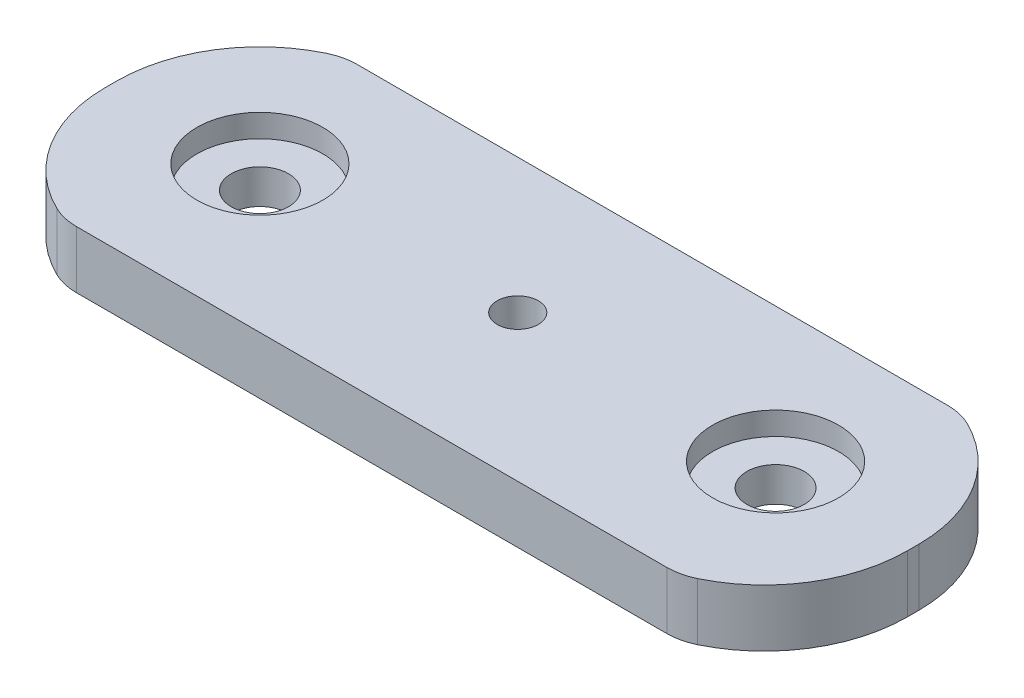
ISO-10303-21;
HEADER;
FILE_DESCRIPTION(('STEP AP214'),'2;1');
FILE_NAME('part.step','',(''),(''),'','','');
FILE_SCHEMA(('AUTOMOTIVE_DESIGN { 1 0 10303 214 1 1 1 1 }'));
ENDSEC;
DATA;
#1=APPLICATION_CONTEXT('core data for automotive mechanical design processes');
#2=APPLICATION_PROTOCOL_DEFINITION('international standard','automotive_design',2000,#1);
#3=PRODUCT_CONTEXT('',#1,'mechanical');
#4=PRODUCT('Part','Part','',(#3));
#5=PRODUCT_RELATED_PRODUCT_CATEGORY('part','',(#4));
#6=PRODUCT_DEFINITION_FORMATION('','',#4);
#7=PRODUCT_DEFINITION_CONTEXT('part definition',#1,'design');
#8=PRODUCT_DEFINITION('design','',#6,#7);
#9=PRODUCT_DEFINITION_SHAPE('','',#8);
#10=(LENGTH_UNIT() NAMED_UNIT(*) SI_UNIT(.MILLI.,.METRE.));
#11=(NAMED_UNIT(*) PLANE_ANGLE_UNIT() SI_UNIT($,.RADIAN.));
#12=(NAMED_UNIT(*) SI_UNIT($,.STERADIAN.) SOLID_ANGLE_UNIT());
#13=UNCERTAINTY_MEASURE_WITH_UNIT(LENGTH_MEASURE(1.E-05),#10,'distance_accuracy_value','');
#14=(GEOMETRIC_REPRESENTATION_CONTEXT(3) GLOBAL_UNCERTAINTY_ASSIGNED_CONTEXT((#13)) GLOBAL_UNIT_ASSIGNED_CONTEXT((#10,
#11,#12)) REPRESENTATION_CONTEXT('',''));
#15=CARTESIAN_POINT('',(0.,0.,0.));
#16=DIRECTION('',(0.,0.,1.));
#17=DIRECTION('',(1.,0.,0.));
#18=AXIS2_PLACEMENT_3D('',#15,#16,#17);
#19=CARTESIAN_POINT('',(-45.,10.,0.));
#20=DIRECTION('',(0.,1.,0.));
#21=DIRECTION('',(0.,0.,1.));
#22=AXIS2_PLACEMENT_3D('',#19,#20,#21);
#23=PLANE('',#22);
#24=CARTESIAN_POINT('',(45.,10.,0.));
#25=DIRECTION('',(0.,1.,0.));
#26=DIRECTION('',(0.,0.,1.));
#27=AXIS2_PLACEMENT_3D('',#24,#25,#26);
#28=CIRCLE('',#27,11.);
#29=CARTESIAN_POINT('',(45.,10.,11.));
#30=VERTEX_POINT('',#29);
#31=EDGE_CURVE('E186',#30,#30,#28,.T.);
#32=ORIENTED_EDGE('',*,*,#31,.F.);
#33=EDGE_LOOP('',(#32));
#34=FACE_BOUND('',#33,.T.);
#35=CARTESIAN_POINT('',(-45.,10.,0.));
#36=DIRECTION('',(0.,1.,0.));
#37=DIRECTION('',(0.,0.,1.));
#38=AXIS2_PLACEMENT_3D('',#35,#36,#37);
#39=CIRCLE('',#38,11.);
#40=CARTESIAN_POINT('',(-45.,10.,11.));
#41=VERTEX_POINT('',#40);
#42=EDGE_CURVE('E203',#41,#41,#39,.T.);
#43=ORIENTED_EDGE('',*,*,#42,.F.);
#44=EDGE_LOOP('',(#43));
#45=FACE_BOUND('',#44,.T.);
#46=DIRECTION('',(1.,0.,0.));
#47=VECTOR('',#46,1.);
#48=CARTESIAN_POINT('',(-61.82898260829,10.,-23.5));
#49=LINE('',#48,#47);
#50=CARTESIAN_POINT('',(-51.538348415311,10.,-23.5));
#51=VERTEX_POINT('',#50);
#52=CARTESIAN_POINT('',(51.538348415311,10.,-23.5));
#53=VERTEX_POINT('',#52);
#54=EDGE_CURVE('E214',#51,#53,#49,.T.);
#55=ORIENTED_EDGE('',*,*,#54,.F.);
#56=CARTESIAN_POINT('',(-51.538348415311,10.,-13.5));
#57=DIRECTION('',(0.,1.,0.));
#58=DIRECTION('',(0.,0.,1.));
#59=AXIS2_PLACEMENT_3D('',#56,#57,#58);
#60=CIRCLE('',#59,10.);
#61=CARTESIAN_POINT('',(-55.8972473588517,10.,-22.5));
#62=VERTEX_POINT('',#61);
#63=EDGE_CURVE('E133',#51,#62,#60,.T.);
#64=ORIENTED_EDGE('',*,*,#63,.T.);
#65=CARTESIAN_POINT('',(-45.,10.,0.));
#66=DIRECTION('',(0.,1.,0.));
#67=DIRECTION('',(0.,0.,1.));
#68=AXIS2_PLACEMENT_3D('',#65,#66,#67);
#69=CIRCLE('',#68,25.);
#70=CARTESIAN_POINT('',(-70.,10.,1.59594559789866E-13));
#71=VERTEX_POINT('',#70);
#72=EDGE_CURVE('E125',#62,#71,#69,.T.);
#73=ORIENTED_EDGE('',*,*,#72,.T.);
#74=DIRECTION('',(0.,0.,1.));
#75=VECTOR('',#74,1.);
#76=CARTESIAN_POINT('',(-70.,10.,1.59594559789866E-13));
#77=LINE('',#76,#75);
#78=CARTESIAN_POINT('',(-70.,10.,1.99999999999982));
#79=VERTEX_POINT('',#78);
#80=EDGE_CURVE('E130',#71,#79,#77,.T.);
#81=ORIENTED_EDGE('',*,*,#80,.T.);
#82=CARTESIAN_POINT('',(-45.,10.,1.99999999999999));
#83=DIRECTION('',(0.,1.,0.));
#84=DIRECTION('',(0.,0.,-1.));
#85=AXIS2_PLACEMENT_3D('',#82,#83,#84);
#86=CIRCLE('',#85,25.);
#87=CARTESIAN_POINT('',(-55.8972473588517,10.,24.5));
#88=VERTEX_POINT('',#87);
#89=EDGE_CURVE('E147',#79,#88,#86,.T.);
#90=ORIENTED_EDGE('',*,*,#89,.T.);
#91=CARTESIAN_POINT('',(-51.538348415311,10.,15.5));
#92=DIRECTION('',(0.,1.,0.));
#93=DIRECTION('',(0.,0.,1.));
#94=AXIS2_PLACEMENT_3D('',#91,#92,#93);
#95=CIRCLE('',#94,10.);
#96=CARTESIAN_POINT('',(-51.538348415311,10.,25.5));
#97=VERTEX_POINT('',#96);
#98=EDGE_CURVE('E51',#88,#97,#95,.T.);
#99=ORIENTED_EDGE('',*,*,#98,.T.);
#100=DIRECTION('',(-1.,0.,0.));
#101=VECTOR('',#100,1.);
#102=CARTESIAN_POINT('',(77.1776293447742,10.,25.5));
#103=LINE('',#102,#101);
#104=CARTESIAN_POINT('',(51.538348415311,10.,25.5));
#105=VERTEX_POINT('',#104);
#106=EDGE_CURVE('E208',#105,#97,#103,.T.);
#107=ORIENTED_EDGE('',*,*,#106,.F.);
#108=CARTESIAN_POINT('',(51.538348415311,10.,15.5));
#109=DIRECTION('',(0.,1.,0.));
#110=DIRECTION('',(0.,0.,1.));
#111=AXIS2_PLACEMENT_3D('',#108,#109,#110);
#112=CIRCLE('',#111,10.);
#113=CARTESIAN_POINT('',(55.8972473588517,10.,24.5));
#114=VERTEX_POINT('',#113);
#115=EDGE_CURVE('E173',#105,#114,#112,.T.);
#116=ORIENTED_EDGE('',*,*,#115,.T.);
#117=CARTESIAN_POINT('',(45.,10.,1.99999999999999));
#118=DIRECTION('',(0.,1.,0.));
#119=DIRECTION('',(0.,0.,-1.));
#120=AXIS2_PLACEMENT_3D('',#117,#118,#119);
#121=CIRCLE('',#120,25.);
#122=CARTESIAN_POINT('',(70.,10.,1.99999999999982));
#123=VERTEX_POINT('',#122);
#124=EDGE_CURVE('E223',#114,#123,#121,.T.);
#125=ORIENTED_EDGE('',*,*,#124,.T.);
#126=DIRECTION('',(0.,0.,-1.));
#127=VECTOR('',#126,1.);
#128=CARTESIAN_POINT('',(70.,10.,1.66533453693773E-13));
#129=LINE('',#128,#127);
#130=CARTESIAN_POINT('',(70.,10.,1.66533453693773E-13));
#131=VERTEX_POINT('',#130);
#132=EDGE_CURVE('E225',#123,#131,#129,.T.);
#133=ORIENTED_EDGE('',*,*,#132,.T.);
#134=CARTESIAN_POINT('',(45.,10.,0.));
#135=DIRECTION('',(0.,1.,0.));
#136=DIRECTION('',(0.,0.,-1.));
#137=AXIS2_PLACEMENT_3D('',#134,#135,#136);
#138=CIRCLE('',#137,25.);
#139=CARTESIAN_POINT('',(55.8972473588517,10.,-22.5));
#140=VERTEX_POINT('',#139);
#141=EDGE_CURVE('E227',#131,#140,#138,.T.);
#142=ORIENTED_EDGE('',*,*,#141,.T.);
#143=CARTESIAN_POINT('',(51.538348415311,10.,-13.5));
#144=DIRECTION('',(0.,1.,0.));
#145=DIRECTION('',(0.,0.,1.));
#146=AXIS2_PLACEMENT_3D('',#143,#144,#145);
#147=CIRCLE('',#146,10.);
#148=EDGE_CURVE('E58',#140,#53,#147,.T.);
#149=ORIENTED_EDGE('',*,*,#148,.T.);
#150=EDGE_LOOP('',(#55,#64,#73,#81,#90,#99,#107,#116,#125,#133,#142,#149));
#151=FACE_BOUND('',#150,.T.);
#152=CARTESIAN_POINT('',(0.,10.,0.));
#153=DIRECTION('',(0.,-1.,0.));
#154=DIRECTION('',(0.,0.,-1.));
#155=AXIS2_PLACEMENT_3D('',#152,#153,#154);
#156=CIRCLE('',#155,3.59);
#157=CARTESIAN_POINT('',(0.,10.,-3.59));
#158=VERTEX_POINT('',#157);
#159=EDGE_CURVE('E493',#158,#158,#156,.T.);
#160=ORIENTED_EDGE('',*,*,#159,.T.);
#161=EDGE_LOOP('',(#160));
#162=FACE_BOUND('',#161,.T.);
#163=ADVANCED_FACE('F34',(#34,#45,#151,#162),#23,.T.);
#164=CARTESIAN_POINT('',(-45.,0.,0.));
#165=DIRECTION('',(0.,1.,0.));
#166=DIRECTION('',(0.,0.,1.));
#167=AXIS2_PLACEMENT_3D('',#164,#165,#166);
#168=PLANE('',#167);
#169=CARTESIAN_POINT('',(45.,0.,0.));
#170=DIRECTION('',(0.,-1.,0.));
#171=DIRECTION('',(0.,0.,-1.));
#172=AXIS2_PLACEMENT_3D('',#169,#170,#171);
#173=CIRCLE('',#172,5.);
#174=CARTESIAN_POINT('',(45.,0.,-5.));
#175=VERTEX_POINT('',#174);
#176=EDGE_CURVE('E198',#175,#175,#173,.T.);
#177=ORIENTED_EDGE('',*,*,#176,.F.);
#178=EDGE_LOOP('',(#177));
#179=FACE_BOUND('',#178,.T.);
#180=CARTESIAN_POINT('',(-45.,0.,0.));
#181=DIRECTION('',(0.,-1.,0.));
#182=DIRECTION('',(0.,0.,-1.));
#183=AXIS2_PLACEMENT_3D('',#180,#181,#182);
#184=CIRCLE('',#183,5.);
#185=CARTESIAN_POINT('',(-45.,0.,-5.));
#186=VERTEX_POINT('',#185);
#187=EDGE_CURVE('E187',#186,#186,#184,.T.);
#188=ORIENTED_EDGE('',*,*,#187,.F.);
#189=EDGE_LOOP('',(#188));
#190=FACE_BOUND('',#189,.T.);
#191=CARTESIAN_POINT('',(-45.,0.,0.));
#192=DIRECTION('',(0.,1.,0.));
#193=DIRECTION('',(0.,0.,1.));
#194=AXIS2_PLACEMENT_3D('',#191,#192,#193);
#195=CIRCLE('',#194,25.);
#196=CARTESIAN_POINT('',(-55.8972473588517,0.,-22.5));
#197=VERTEX_POINT('',#196);
#198=CARTESIAN_POINT('',(-70.,0.,1.59594559789866E-13));
#199=VERTEX_POINT('',#198);
#200=EDGE_CURVE('E151',#197,#199,#195,.T.);
#201=ORIENTED_EDGE('',*,*,#200,.F.);
#202=CARTESIAN_POINT('',(-51.538348415311,0.,-13.5));
#203=DIRECTION('',(0.,1.,0.));
#204=DIRECTION('',(0.,0.,1.));
#205=AXIS2_PLACEMENT_3D('',#202,#203,#204);
#206=CIRCLE('',#205,10.);
#207=CARTESIAN_POINT('',(-51.538348415311,0.,-23.5));
#208=VERTEX_POINT('',#207);
#209=EDGE_CURVE('E166',#197,#208,#206,.F.);
#210=ORIENTED_EDGE('',*,*,#209,.T.);
#211=DIRECTION('',(1.,0.,0.));
#212=VECTOR('',#211,1.);
#213=CARTESIAN_POINT('',(-61.82898260829,0.,-23.5));
#214=LINE('',#213,#212);
#215=CARTESIAN_POINT('',(51.538348415311,0.,-23.5));
#216=VERTEX_POINT('',#215);
#217=EDGE_CURVE('E217',#208,#216,#214,.T.);
#218=ORIENTED_EDGE('',*,*,#217,.T.);
#219=CARTESIAN_POINT('',(51.538348415311,0.,-13.5));
#220=DIRECTION('',(0.,1.,0.));
#221=DIRECTION('',(0.,0.,1.));
#222=AXIS2_PLACEMENT_3D('',#219,#220,#221);
#223=CIRCLE('',#222,10.);
#224=CARTESIAN_POINT('',(55.8972473588517,0.,-22.5));
#225=VERTEX_POINT('',#224);
#226=EDGE_CURVE('E164',#216,#225,#223,.F.);
#227=ORIENTED_EDGE('',*,*,#226,.T.);
#228=CARTESIAN_POINT('',(45.,0.,0.));
#229=DIRECTION('',(0.,1.,0.));
#230=DIRECTION('',(0.,0.,-1.));
#231=AXIS2_PLACEMENT_3D('',#228,#229,#230);
#232=CIRCLE('',#231,25.);
#233=CARTESIAN_POINT('',(70.,0.,1.66533453693773E-13));
#234=VERTEX_POINT('',#233);
#235=EDGE_CURVE('E138',#234,#225,#232,.T.);
#236=ORIENTED_EDGE('',*,*,#235,.F.);
#237=DIRECTION('',(0.,0.,-1.));
#238=VECTOR('',#237,1.);
#239=CARTESIAN_POINT('',(70.,0.,1.66533453693773E-13));
#240=LINE('',#239,#238);
#241=CARTESIAN_POINT('',(70.,0.,1.99999999999982));
#242=VERTEX_POINT('',#241);
#243=EDGE_CURVE('E239',#242,#234,#240,.T.);
#244=ORIENTED_EDGE('',*,*,#243,.F.);
#245=CARTESIAN_POINT('',(45.,0.,1.99999999999999));
#246=DIRECTION('',(0.,1.,0.));
#247=DIRECTION('',(0.,0.,-1.));
#248=AXIS2_PLACEMENT_3D('',#245,#246,#247);
#249=CIRCLE('',#248,25.);
#250=CARTESIAN_POINT('',(55.8972473588517,0.,24.5));
#251=VERTEX_POINT('',#250);
#252=EDGE_CURVE('E237',#251,#242,#249,.T.);
#253=ORIENTED_EDGE('',*,*,#252,.F.);
#254=CARTESIAN_POINT('',(51.538348415311,0.,15.5));
#255=DIRECTION('',(0.,1.,0.));
#256=DIRECTION('',(0.,0.,1.));
#257=AXIS2_PLACEMENT_3D('',#254,#255,#256);
#258=CIRCLE('',#257,10.);
#259=CARTESIAN_POINT('',(51.538348415311,0.,25.5));
#260=VERTEX_POINT('',#259);
#261=EDGE_CURVE('E162',#251,#260,#258,.F.);
#262=ORIENTED_EDGE('',*,*,#261,.T.);
#263=DIRECTION('',(-1.,0.,0.));
#264=VECTOR('',#263,1.);
#265=CARTESIAN_POINT('',(77.1776293447742,0.,25.5));
#266=LINE('',#265,#264);
#267=CARTESIAN_POINT('',(-51.538348415311,0.,25.5));
#268=VERTEX_POINT('',#267);
#269=EDGE_CURVE('E211',#260,#268,#266,.T.);
#270=ORIENTED_EDGE('',*,*,#269,.T.);
#271=CARTESIAN_POINT('',(-51.538348415311,0.,15.5));
#272=DIRECTION('',(0.,1.,0.));
#273=DIRECTION('',(0.,0.,1.));
#274=AXIS2_PLACEMENT_3D('',#271,#272,#273);
#275=CIRCLE('',#274,10.);
#276=CARTESIAN_POINT('',(-55.8972473588517,0.,24.5));
#277=VERTEX_POINT('',#276);
#278=EDGE_CURVE('E155',#268,#277,#275,.F.);
#279=ORIENTED_EDGE('',*,*,#278,.T.);
#280=CARTESIAN_POINT('',(-45.,0.,1.99999999999999));
#281=DIRECTION('',(0.,1.,0.));
#282=DIRECTION('',(0.,0.,-1.));
#283=AXIS2_PLACEMENT_3D('',#280,#281,#282);
#284=CIRCLE('',#283,25.);
#285=CARTESIAN_POINT('',(-70.,0.,1.99999999999982));
#286=VERTEX_POINT('',#285);
#287=EDGE_CURVE('E234',#286,#277,#284,.T.);
#288=ORIENTED_EDGE('',*,*,#287,.F.);
#289=DIRECTION('',(0.,0.,1.));
#290=VECTOR('',#289,1.);
#291=CARTESIAN_POINT('',(-70.,0.,1.59594559789866E-13));
#292=LINE('',#291,#290);
#293=EDGE_CURVE('E232',#199,#286,#292,.T.);
#294=ORIENTED_EDGE('',*,*,#293,.F.);
#295=EDGE_LOOP('',(#201,#210,#218,#227,#236,#244,#253,#262,#270,#279,#288,#294));
#296=FACE_BOUND('',#295,.T.);
#297=CARTESIAN_POINT('',(0.,0.,0.));
#298=DIRECTION('',(0.,-1.,0.));
#299=DIRECTION('',(0.,0.,-1.));
#300=AXIS2_PLACEMENT_3D('',#297,#298,#299);
#301=CIRCLE('',#300,3.59);
#302=CARTESIAN_POINT('',(0.,0.,-3.59));
#303=VERTEX_POINT('',#302);
#304=EDGE_CURVE('E490',#303,#303,#301,.T.);
#305=ORIENTED_EDGE('',*,*,#304,.F.);
#306=EDGE_LOOP('',(#305));
#307=FACE_BOUND('',#306,.T.);
#308=ADVANCED_FACE('F256',(#179,#190,#296,#307),#168,.F.);
#309=CARTESIAN_POINT('',(-45.,10.,0.));
#310=DIRECTION('',(0.,-1.,0.));
#311=DIRECTION('',(0.,0.,-1.));
#312=AXIS2_PLACEMENT_3D('',#309,#310,#311);
#313=CYLINDRICAL_SURFACE('',#312,25.);
#314=ORIENTED_EDGE('',*,*,#72,.F.);
#315=DIRECTION('',(0.,-1.,0.));
#316=VECTOR('',#315,1.);
#317=CARTESIAN_POINT('',(-55.8972473588517,10.,-22.5));
#318=LINE('',#317,#316);
#319=EDGE_CURVE('E153',#62,#197,#318,.T.);
#320=ORIENTED_EDGE('',*,*,#319,.T.);
#321=ORIENTED_EDGE('',*,*,#200,.T.);
#322=DIRECTION('',(0.,-1.,0.));
#323=VECTOR('',#322,1.);
#324=CARTESIAN_POINT('',(-70.,10.,1.59594559789866E-13));
#325=LINE('',#324,#323);
#326=EDGE_CURVE('E143',#71,#199,#325,.T.);
#327=ORIENTED_EDGE('',*,*,#326,.F.);
#328=EDGE_LOOP('',(#314,#320,#321,#327));
#329=FACE_BOUND('',#328,.T.);
#330=ADVANCED_FACE('F149',(#329),#313,.T.);
#331=CARTESIAN_POINT('',(-70.,10.,1.59594559789866E-13));
#332=DIRECTION('',(1.,0.,0.));
#333=DIRECTION('',(0.,0.,-1.));
#334=AXIS2_PLACEMENT_3D('',#331,#332,#333);
#335=PLANE('',#334);
#336=ORIENTED_EDGE('',*,*,#293,.T.);
#337=DIRECTION('',(0.,-1.,0.));
#338=VECTOR('',#337,1.);
#339=CARTESIAN_POINT('',(-70.,10.,1.99999999999982));
#340=LINE('',#339,#338);
#341=EDGE_CURVE('E145',#79,#286,#340,.T.);
#342=ORIENTED_EDGE('',*,*,#341,.F.);
#343=ORIENTED_EDGE('',*,*,#80,.F.);
#344=ORIENTED_EDGE('',*,*,#326,.T.);
#345=EDGE_LOOP('',(#336,#342,#343,#344));
#346=FACE_BOUND('',#345,.T.);
#347=ADVANCED_FACE('F142',(#346),#335,.F.);
#348=CARTESIAN_POINT('',(-45.,10.,1.99999999999999));
#349=DIRECTION('',(0.,-1.,0.));
#350=DIRECTION('',(0.,0.,-1.));
#351=AXIS2_PLACEMENT_3D('',#348,#349,#350);
#352=CYLINDRICAL_SURFACE('',#351,25.);
#353=ORIENTED_EDGE('',*,*,#287,.T.);
#354=DIRECTION('',(0.,-1.,0.));
#355=VECTOR('',#354,1.);
#356=CARTESIAN_POINT('',(-55.8972473588517,10.,24.5));
#357=LINE('',#356,#355);
#358=EDGE_CURVE('E11',#277,#88,#357,.F.);
#359=ORIENTED_EDGE('',*,*,#358,.T.);
#360=ORIENTED_EDGE('',*,*,#89,.F.);
#361=ORIENTED_EDGE('',*,*,#341,.T.);
#362=EDGE_LOOP('',(#353,#359,#360,#361));
#363=FACE_BOUND('',#362,.T.);
#364=ADVANCED_FACE('F282',(#363),#352,.T.);
#365=CARTESIAN_POINT('',(45.,10.,1.99999999999999));
#366=DIRECTION('',(0.,-1.,0.));
#367=DIRECTION('',(0.,0.,-1.));
#368=AXIS2_PLACEMENT_3D('',#365,#366,#367);
#369=CYLINDRICAL_SURFACE('',#368,25.);
#370=ORIENTED_EDGE('',*,*,#124,.F.);
#371=DIRECTION('',(0.,-1.,0.));
#372=VECTOR('',#371,1.);
#373=CARTESIAN_POINT('',(55.8972473588517,10.,24.5));
#374=LINE('',#373,#372);
#375=EDGE_CURVE('E179',#114,#251,#374,.T.);
#376=ORIENTED_EDGE('',*,*,#375,.T.);
#377=ORIENTED_EDGE('',*,*,#252,.T.);
#378=DIRECTION('',(0.,-1.,0.));
#379=VECTOR('',#378,1.);
#380=CARTESIAN_POINT('',(70.,10.,1.99999999999982));
#381=LINE('',#380,#379);
#382=EDGE_CURVE('E157',#123,#242,#381,.T.);
#383=ORIENTED_EDGE('',*,*,#382,.F.);
#384=EDGE_LOOP('',(#370,#376,#377,#383));
#385=FACE_BOUND('',#384,.T.);
#386=ADVANCED_FACE('F272',(#385),#369,.T.);
#387=CARTESIAN_POINT('',(70.,10.,1.66533453693773E-13));
#388=DIRECTION('',(-1.,0.,0.));
#389=DIRECTION('',(0.,0.,1.));
#390=AXIS2_PLACEMENT_3D('',#387,#388,#389);
#391=PLANE('',#390);
#392=ORIENTED_EDGE('',*,*,#243,.T.);
#393=DIRECTION('',(0.,-1.,0.));
#394=VECTOR('',#393,1.);
#395=CARTESIAN_POINT('',(70.,10.,1.66533453693773E-13));
#396=LINE('',#395,#394);
#397=EDGE_CURVE('E230',#131,#234,#396,.T.);
#398=ORIENTED_EDGE('',*,*,#397,.F.);
#399=ORIENTED_EDGE('',*,*,#132,.F.);
#400=ORIENTED_EDGE('',*,*,#382,.T.);
#401=EDGE_LOOP('',(#392,#398,#399,#400));
#402=FACE_BOUND('',#401,.T.);
#403=ADVANCED_FACE('F249',(#402),#391,.F.);
#404=CARTESIAN_POINT('',(45.,10.,0.));
#405=DIRECTION('',(0.,-1.,0.));
#406=DIRECTION('',(0.,0.,-1.));
#407=AXIS2_PLACEMENT_3D('',#404,#405,#406);
#408=CYLINDRICAL_SURFACE('',#407,25.);
#409=ORIENTED_EDGE('',*,*,#235,.T.);
#410=DIRECTION('',(0.,-1.,0.));
#411=VECTOR('',#410,1.);
#412=CARTESIAN_POINT('',(55.8972473588517,10.,-22.5));
#413=LINE('',#412,#411);
#414=EDGE_CURVE('E177',#225,#140,#413,.F.);
#415=ORIENTED_EDGE('',*,*,#414,.T.);
#416=ORIENTED_EDGE('',*,*,#141,.F.);
#417=ORIENTED_EDGE('',*,*,#397,.T.);
#418=EDGE_LOOP('',(#409,#415,#416,#417));
#419=FACE_BOUND('',#418,.T.);
#420=ADVANCED_FACE('F260',(#419),#408,.T.);
#421=CARTESIAN_POINT('',(-61.82898260829,0.,-23.5));
#422=DIRECTION('',(0.,0.,1.));
#423=DIRECTION('',(1.,0.,0.));
#424=AXIS2_PLACEMENT_3D('',#421,#422,#423);
#425=PLANE('',#424);
#426=ORIENTED_EDGE('',*,*,#217,.F.);
#427=DIRECTION('',(0.,-1.,0.));
#428=VECTOR('',#427,1.);
#429=CARTESIAN_POINT('',(-51.538348415311,0.,-23.5));
#430=LINE('',#429,#428);
#431=EDGE_CURVE('E170',#208,#51,#430,.F.);
#432=ORIENTED_EDGE('',*,*,#431,.T.);
#433=ORIENTED_EDGE('',*,*,#54,.T.);
#434=DIRECTION('',(0.,-1.,0.));
#435=VECTOR('',#434,1.);
#436=CARTESIAN_POINT('',(51.538348415311,0.,-23.5));
#437=LINE('',#436,#435);
#438=EDGE_CURVE('E168',#53,#216,#437,.T.);
#439=ORIENTED_EDGE('',*,*,#438,.T.);
#440=EDGE_LOOP('',(#426,#432,#433,#439));
#441=FACE_BOUND('',#440,.T.);
#442=ADVANCED_FACE('F265',(#441),#425,.F.);
#443=CARTESIAN_POINT('',(77.1776293447742,0.,25.5));
#444=DIRECTION('',(0.,0.,-1.));
#445=DIRECTION('',(-1.,0.,0.));
#446=AXIS2_PLACEMENT_3D('',#443,#444,#445);
#447=PLANE('',#446);
#448=ORIENTED_EDGE('',*,*,#269,.F.);
#449=DIRECTION('',(0.,-1.,0.));
#450=VECTOR('',#449,1.);
#451=CARTESIAN_POINT('',(51.538348415311,0.,25.5));
#452=LINE('',#451,#450);
#453=EDGE_CURVE('E43',#260,#105,#452,.F.);
#454=ORIENTED_EDGE('',*,*,#453,.T.);
#455=ORIENTED_EDGE('',*,*,#106,.T.);
#456=DIRECTION('',(0.,-1.,0.));
#457=VECTOR('',#456,1.);
#458=CARTESIAN_POINT('',(-51.538348415311,0.,25.5));
#459=LINE('',#458,#457);
#460=EDGE_CURVE('E182',#97,#268,#459,.T.);
#461=ORIENTED_EDGE('',*,*,#460,.T.);
#462=EDGE_LOOP('',(#448,#454,#455,#461));
#463=FACE_BOUND('',#462,.T.);
#464=ADVANCED_FACE('F279',(#463),#447,.F.);
#465=CARTESIAN_POINT('',(-51.538348415311,10.,-13.5));
#466=DIRECTION('',(0.,-1.,0.));
#467=DIRECTION('',(0.,0.,-1.));
#468=AXIS2_PLACEMENT_3D('',#465,#466,#467);
#469=CYLINDRICAL_SURFACE('',#468,10.);
#470=ORIENTED_EDGE('',*,*,#63,.F.);
#471=ORIENTED_EDGE('',*,*,#431,.F.);
#472=ORIENTED_EDGE('',*,*,#209,.F.);
#473=ORIENTED_EDGE('',*,*,#319,.F.);
#474=EDGE_LOOP('',(#470,#471,#472,#473));
#475=FACE_BOUND('',#474,.T.);
#476=ADVANCED_FACE('F268',(#475),#469,.T.);
#477=CARTESIAN_POINT('',(51.538348415311,10.,-13.5));
#478=DIRECTION('',(0.,-1.,0.));
#479=DIRECTION('',(0.,0.,-1.));
#480=AXIS2_PLACEMENT_3D('',#477,#478,#479);
#481=CYLINDRICAL_SURFACE('',#480,10.);
#482=ORIENTED_EDGE('',*,*,#226,.F.);
#483=ORIENTED_EDGE('',*,*,#438,.F.);
#484=ORIENTED_EDGE('',*,*,#148,.F.);
#485=ORIENTED_EDGE('',*,*,#414,.F.);
#486=EDGE_LOOP('',(#482,#483,#484,#485));
#487=FACE_BOUND('',#486,.T.);
#488=ADVANCED_FACE('F262',(#487),#481,.T.);
#489=CARTESIAN_POINT('',(51.538348415311,10.,15.5));
#490=DIRECTION('',(0.,-1.,0.));
#491=DIRECTION('',(0.,0.,-1.));
#492=AXIS2_PLACEMENT_3D('',#489,#490,#491);
#493=CYLINDRICAL_SURFACE('',#492,10.);
#494=ORIENTED_EDGE('',*,*,#115,.F.);
#495=ORIENTED_EDGE('',*,*,#453,.F.);
#496=ORIENTED_EDGE('',*,*,#261,.F.);
#497=ORIENTED_EDGE('',*,*,#375,.F.);
#498=EDGE_LOOP('',(#494,#495,#496,#497));
#499=FACE_BOUND('',#498,.T.);
#500=ADVANCED_FACE('F274',(#499),#493,.T.);
#501=CARTESIAN_POINT('',(-51.538348415311,10.,15.5));
#502=DIRECTION('',(0.,-1.,0.));
#503=DIRECTION('',(0.,0.,-1.));
#504=AXIS2_PLACEMENT_3D('',#501,#502,#503);
#505=CYLINDRICAL_SURFACE('',#504,10.);
#506=ORIENTED_EDGE('',*,*,#278,.F.);
#507=ORIENTED_EDGE('',*,*,#460,.F.);
#508=ORIENTED_EDGE('',*,*,#98,.F.);
#509=ORIENTED_EDGE('',*,*,#358,.F.);
#510=EDGE_LOOP('',(#506,#507,#508,#509));
#511=FACE_BOUND('',#510,.T.);
#512=ADVANCED_FACE('F36',(#511),#505,.T.);
#513=CARTESIAN_POINT('',(-45.,6.,0.));
#514=DIRECTION('',(0.,1.,0.));
#515=DIRECTION('',(0.,0.,1.));
#516=AXIS2_PLACEMENT_3D('',#513,#514,#515);
#517=CYLINDRICAL_SURFACE('',#516,11.);
#518=CARTESIAN_POINT('',(-45.,6.,0.));
#519=DIRECTION('',(0.,1.,0.));
#520=DIRECTION('',(0.,0.,1.));
#521=AXIS2_PLACEMENT_3D('',#518,#519,#520);
#522=CIRCLE('',#521,11.);
#523=CARTESIAN_POINT('',(-45.,6.,11.));
#524=VERTEX_POINT('',#523);
#525=EDGE_CURVE('E205',#524,#524,#522,.T.);
#526=ORIENTED_EDGE('',*,*,#525,.F.);
#527=EDGE_LOOP('',(#526));
#528=FACE_BOUND('',#527,.T.);
#529=ORIENTED_EDGE('',*,*,#42,.T.);
#530=EDGE_LOOP('',(#529));
#531=FACE_BOUND('',#530,.T.);
#532=ADVANCED_FACE('F350',(#528,#531),#517,.F.);
#533=CARTESIAN_POINT('',(-45.,6.,0.));
#534=DIRECTION('',(0.,1.,0.));
#535=DIRECTION('',(0.,0.,1.));
#536=AXIS2_PLACEMENT_3D('',#533,#534,#535);
#537=PLANE('',#536);
#538=CARTESIAN_POINT('',(-45.,6.,0.));
#539=DIRECTION('',(0.,1.,0.));
#540=DIRECTION('',(0.,0.,1.));
#541=AXIS2_PLACEMENT_3D('',#538,#539,#540);
#542=CIRCLE('',#541,5.);
#543=CARTESIAN_POINT('',(-45.,6.,5.));
#544=VERTEX_POINT('',#543);
#545=EDGE_CURVE('E184',#544,#544,#542,.T.);
#546=ORIENTED_EDGE('',*,*,#545,.F.);
#547=EDGE_LOOP('',(#546));
#548=FACE_BOUND('',#547,.T.);
#549=ORIENTED_EDGE('',*,*,#525,.T.);
#550=EDGE_LOOP('',(#549));
#551=FACE_BOUND('',#550,.T.);
#552=ADVANCED_FACE('F356',(#548,#551),#537,.T.);
#553=CARTESIAN_POINT('',(45.,6.,0.));
#554=DIRECTION('',(0.,1.,0.));
#555=DIRECTION('',(0.,0.,1.));
#556=AXIS2_PLACEMENT_3D('',#553,#554,#555);
#557=CYLINDRICAL_SURFACE('',#556,11.);
#558=CARTESIAN_POINT('',(45.,6.,0.));
#559=DIRECTION('',(0.,1.,0.));
#560=DIRECTION('',(0.,0.,1.));
#561=AXIS2_PLACEMENT_3D('',#558,#559,#560);
#562=CIRCLE('',#561,11.);
#563=CARTESIAN_POINT('',(45.,6.,11.));
#564=VERTEX_POINT('',#563);
#565=EDGE_CURVE('E191',#564,#564,#562,.T.);
#566=ORIENTED_EDGE('',*,*,#565,.F.);
#567=EDGE_LOOP('',(#566));
#568=FACE_BOUND('',#567,.T.);
#569=ORIENTED_EDGE('',*,*,#31,.T.);
#570=EDGE_LOOP('',(#569));
#571=FACE_BOUND('',#570,.T.);
#572=ADVANCED_FACE('F365',(#568,#571),#557,.F.);
#573=CARTESIAN_POINT('',(45.,6.,0.));
#574=DIRECTION('',(0.,1.,0.));
#575=DIRECTION('',(0.,0.,1.));
#576=AXIS2_PLACEMENT_3D('',#573,#574,#575);
#577=PLANE('',#576);
#578=CARTESIAN_POINT('',(45.,6.,0.));
#579=DIRECTION('',(0.,1.,0.));
#580=DIRECTION('',(0.,0.,1.));
#581=AXIS2_PLACEMENT_3D('',#578,#579,#580);
#582=CIRCLE('',#581,5.);
#583=CARTESIAN_POINT('',(45.,6.,5.));
#584=VERTEX_POINT('',#583);
#585=EDGE_CURVE('E38',#584,#584,#582,.T.);
#586=ORIENTED_EDGE('',*,*,#585,.F.);
#587=EDGE_LOOP('',(#586));
#588=FACE_BOUND('',#587,.T.);
#589=ORIENTED_EDGE('',*,*,#565,.T.);
#590=EDGE_LOOP('',(#589));
#591=FACE_BOUND('',#590,.T.);
#592=ADVANCED_FACE('F373',(#588,#591),#577,.T.);
#593=CARTESIAN_POINT('',(-45.,53.,0.));
#594=DIRECTION('',(0.,-1.,0.));
#595=DIRECTION('',(0.,0.,-1.));
#596=AXIS2_PLACEMENT_3D('',#593,#594,#595);
#597=CYLINDRICAL_SURFACE('',#596,5.);
#598=ORIENTED_EDGE('',*,*,#545,.T.);
#599=EDGE_LOOP('',(#598));
#600=FACE_BOUND('',#599,.T.);
#601=ORIENTED_EDGE('',*,*,#187,.T.);
#602=EDGE_LOOP('',(#601));
#603=FACE_BOUND('',#602,.T.);
#604=ADVANCED_FACE('F380',(#600,#603),#597,.F.);
#605=CARTESIAN_POINT('',(45.,53.,0.));
#606=DIRECTION('',(0.,-1.,0.));
#607=DIRECTION('',(0.,0.,-1.));
#608=AXIS2_PLACEMENT_3D('',#605,#606,#607);
#609=CYLINDRICAL_SURFACE('',#608,5.);
#610=ORIENTED_EDGE('',*,*,#585,.T.);
#611=EDGE_LOOP('',(#610));
#612=FACE_BOUND('',#611,.T.);
#613=ORIENTED_EDGE('',*,*,#176,.T.);
#614=EDGE_LOOP('',(#613));
#615=FACE_BOUND('',#614,.T.);
#616=ADVANCED_FACE('F388',(#612,#615),#609,.F.);
#617=CARTESIAN_POINT('',(0.,10.,0.));
#618=DIRECTION('',(0.,-1.,0.));
#619=DIRECTION('',(0.,0.,-1.));
#620=AXIS2_PLACEMENT_3D('',#617,#618,#619);
#621=CYLINDRICAL_SURFACE('',#620,3.59);
#622=ORIENTED_EDGE('',*,*,#304,.T.);
#623=EDGE_LOOP('',(#622));
#624=FACE_BOUND('',#623,.T.);
#625=ORIENTED_EDGE('',*,*,#159,.F.);
#626=EDGE_LOOP('',(#625));
#627=FACE_BOUND('',#626,.T.);
#628=ADVANCED_FACE('F395',(#624,#627),#621,.F.);
#629=CLOSED_SHELL('',(#163,#308,#330,#347,#364,#386,#403,#420,#442,#464,#476,#488,#500,#512,
#532,#552,#572,#592,#604,#616,#628));
#630=MANIFOLD_SOLID_BREP('B2',#629);
#631=ADVANCED_BREP_SHAPE_REPRESENTATION('',(#18,#630),#14);
#632=SHAPE_DEFINITION_REPRESENTATION(#9,#631);
ENDSEC;
END-ISO-10303-21;
